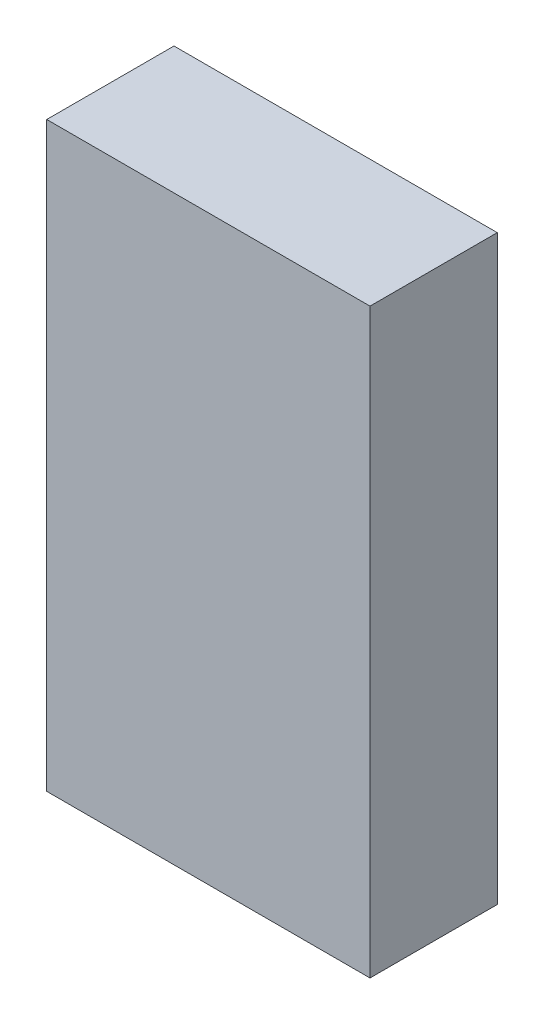
ISO-10303-21;
HEADER;
FILE_DESCRIPTION(('STEP AP214'),'2;1');
FILE_NAME('part.step','',(''),(''),'','','');
FILE_SCHEMA(('AUTOMOTIVE_DESIGN { 1 0 10303 214 1 1 1 1 }'));
ENDSEC;
DATA;
#1=APPLICATION_CONTEXT('core data for automotive mechanical design processes');
#2=APPLICATION_PROTOCOL_DEFINITION('international standard','automotive_design',2000,#1);
#3=PRODUCT_CONTEXT('',#1,'mechanical');
#4=PRODUCT('Part','Part','',(#3));
#5=PRODUCT_RELATED_PRODUCT_CATEGORY('part','',(#4));
#6=PRODUCT_DEFINITION_FORMATION('','',#4);
#7=PRODUCT_DEFINITION_CONTEXT('part definition',#1,'design');
#8=PRODUCT_DEFINITION('design','',#6,#7);
#9=PRODUCT_DEFINITION_SHAPE('','',#8);
#10=(LENGTH_UNIT() NAMED_UNIT(*) SI_UNIT(.MILLI.,.METRE.));
#11=(NAMED_UNIT(*) PLANE_ANGLE_UNIT() SI_UNIT($,.RADIAN.));
#12=(NAMED_UNIT(*) SI_UNIT($,.STERADIAN.) SOLID_ANGLE_UNIT());
#13=UNCERTAINTY_MEASURE_WITH_UNIT(LENGTH_MEASURE(1.E-05),#10,'distance_accuracy_value','');
#14=(GEOMETRIC_REPRESENTATION_CONTEXT(3) GLOBAL_UNCERTAINTY_ASSIGNED_CONTEXT((#13)) GLOBAL_UNIT_ASSIGNED_CONTEXT((#10,
#11,#12)) REPRESENTATION_CONTEXT('',''));
#15=CARTESIAN_POINT('',(0.,0.,0.));
#16=DIRECTION('',(0.,0.,1.));
#17=DIRECTION('',(1.,0.,0.));
#18=AXIS2_PLACEMENT_3D('',#15,#16,#17);
#19=CARTESIAN_POINT('',(-1.27,-2.286,1.));
#20=DIRECTION('',(1.,0.,0.));
#21=DIRECTION('',(0.,0.,-1.));
#22=AXIS2_PLACEMENT_3D('',#19,#20,#21);
#23=PLANE('',#22);
#24=DIRECTION('',(0.,-1.,0.));
#25=VECTOR('',#24,1.);
#26=CARTESIAN_POINT('',(-1.27,-2.286,0.));
#27=LINE('',#26,#25);
#28=CARTESIAN_POINT('',(-1.27,2.286,0.));
#29=VERTEX_POINT('',#28);
#30=CARTESIAN_POINT('',(-1.27,-2.286,0.));
#31=VERTEX_POINT('',#30);
#32=EDGE_CURVE('E95',#29,#31,#27,.T.);
#33=ORIENTED_EDGE('',*,*,#32,.T.);
#34=DIRECTION('',(0.,0.,-1.));
#35=VECTOR('',#34,1.);
#36=CARTESIAN_POINT('',(-1.27,-2.286,1.));
#37=LINE('',#36,#35);
#38=CARTESIAN_POINT('',(-1.27,-2.286,1.));
#39=VERTEX_POINT('',#38);
#40=EDGE_CURVE('E11',#39,#31,#37,.T.);
#41=ORIENTED_EDGE('',*,*,#40,.F.);
#42=DIRECTION('',(0.,-1.,0.));
#43=VECTOR('',#42,1.);
#44=CARTESIAN_POINT('',(-1.27,-2.286,1.));
#45=LINE('',#44,#43);
#46=CARTESIAN_POINT('',(-1.27,2.286,1.));
#47=VERTEX_POINT('',#46);
#48=EDGE_CURVE('E83',#47,#39,#45,.T.);
#49=ORIENTED_EDGE('',*,*,#48,.F.);
#50=DIRECTION('',(0.,0.,-1.));
#51=VECTOR('',#50,1.);
#52=CARTESIAN_POINT('',(-1.27,2.286,1.));
#53=LINE('',#52,#51);
#54=EDGE_CURVE('E91',#47,#29,#53,.T.);
#55=ORIENTED_EDGE('',*,*,#54,.T.);
#56=EDGE_LOOP('',(#33,#41,#49,#55));
#57=FACE_BOUND('',#56,.T.);
#58=ADVANCED_FACE('F32',(#57),#23,.F.);
#59=CARTESIAN_POINT('',(1.27,-2.286,1.));
#60=DIRECTION('',(0.,1.,0.));
#61=DIRECTION('',(0.,0.,1.));
#62=AXIS2_PLACEMENT_3D('',#59,#60,#61);
#63=PLANE('',#62);
#64=DIRECTION('',(1.,0.,0.));
#65=VECTOR('',#64,1.);
#66=CARTESIAN_POINT('',(1.27,-2.286,0.));
#67=LINE('',#66,#65);
#68=CARTESIAN_POINT('',(1.27,-2.286,0.));
#69=VERTEX_POINT('',#68);
#70=EDGE_CURVE('E87',#31,#69,#67,.T.);
#71=ORIENTED_EDGE('',*,*,#70,.T.);
#72=DIRECTION('',(0.,0.,-1.));
#73=VECTOR('',#72,1.);
#74=CARTESIAN_POINT('',(1.27,-2.286,1.));
#75=LINE('',#74,#73);
#76=CARTESIAN_POINT('',(1.27,-2.286,1.));
#77=VERTEX_POINT('',#76);
#78=EDGE_CURVE('E40',#77,#69,#75,.T.);
#79=ORIENTED_EDGE('',*,*,#78,.F.);
#80=DIRECTION('',(1.,0.,0.));
#81=VECTOR('',#80,1.);
#82=CARTESIAN_POINT('',(1.27,-2.286,1.));
#83=LINE('',#82,#81);
#84=EDGE_CURVE('E78',#39,#77,#83,.T.);
#85=ORIENTED_EDGE('',*,*,#84,.F.);
#86=ORIENTED_EDGE('',*,*,#40,.T.);
#87=EDGE_LOOP('',(#71,#79,#85,#86));
#88=FACE_BOUND('',#87,.T.);
#89=ADVANCED_FACE('F86',(#88),#63,.F.);
#90=CARTESIAN_POINT('',(1.27,2.286,1.));
#91=DIRECTION('',(-1.,0.,0.));
#92=DIRECTION('',(0.,0.,1.));
#93=AXIS2_PLACEMENT_3D('',#90,#91,#92);
#94=PLANE('',#93);
#95=DIRECTION('',(0.,1.,0.));
#96=VECTOR('',#95,1.);
#97=CARTESIAN_POINT('',(1.27,2.286,0.));
#98=LINE('',#97,#96);
#99=CARTESIAN_POINT('',(1.27,2.286,0.));
#100=VERTEX_POINT('',#99);
#101=EDGE_CURVE('E65',#69,#100,#98,.T.);
#102=ORIENTED_EDGE('',*,*,#101,.T.);
#103=DIRECTION('',(0.,0.,-1.));
#104=VECTOR('',#103,1.);
#105=CARTESIAN_POINT('',(1.27,2.286,1.));
#106=LINE('',#105,#104);
#107=CARTESIAN_POINT('',(1.27,2.286,1.));
#108=VERTEX_POINT('',#107);
#109=EDGE_CURVE('E88',#108,#100,#106,.T.);
#110=ORIENTED_EDGE('',*,*,#109,.F.);
#111=DIRECTION('',(0.,1.,0.));
#112=VECTOR('',#111,1.);
#113=CARTESIAN_POINT('',(1.27,2.286,1.));
#114=LINE('',#113,#112);
#115=EDGE_CURVE('E81',#77,#108,#114,.T.);
#116=ORIENTED_EDGE('',*,*,#115,.F.);
#117=ORIENTED_EDGE('',*,*,#78,.T.);
#118=EDGE_LOOP('',(#102,#110,#116,#117));
#119=FACE_BOUND('',#118,.T.);
#120=ADVANCED_FACE('F89',(#119),#94,.F.);
#121=CARTESIAN_POINT('',(-1.27,2.286,1.));
#122=DIRECTION('',(0.,-1.,0.));
#123=DIRECTION('',(0.,0.,-1.));
#124=AXIS2_PLACEMENT_3D('',#121,#122,#123);
#125=PLANE('',#124);
#126=DIRECTION('',(-1.,0.,0.));
#127=VECTOR('',#126,1.);
#128=CARTESIAN_POINT('',(-1.27,2.286,0.));
#129=LINE('',#128,#127);
#130=EDGE_CURVE('E71',#100,#29,#129,.T.);
#131=ORIENTED_EDGE('',*,*,#130,.T.);
#132=ORIENTED_EDGE('',*,*,#54,.F.);
#133=DIRECTION('',(-1.,0.,0.));
#134=VECTOR('',#133,1.);
#135=CARTESIAN_POINT('',(-1.27,2.286,1.));
#136=LINE('',#135,#134);
#137=EDGE_CURVE('E48',#108,#47,#136,.T.);
#138=ORIENTED_EDGE('',*,*,#137,.F.);
#139=ORIENTED_EDGE('',*,*,#109,.T.);
#140=EDGE_LOOP('',(#131,#132,#138,#139));
#141=FACE_BOUND('',#140,.T.);
#142=ADVANCED_FACE('F102',(#141),#125,.F.);
#143=CARTESIAN_POINT('',(0.,0.,1.));
#144=DIRECTION('',(0.,0.,-1.));
#145=DIRECTION('',(-1.,0.,0.));
#146=AXIS2_PLACEMENT_3D('',#143,#144,#145);
#147=PLANE('',#146);
#148=ORIENTED_EDGE('',*,*,#48,.T.);
#149=ORIENTED_EDGE('',*,*,#84,.T.);
#150=ORIENTED_EDGE('',*,*,#115,.T.);
#151=ORIENTED_EDGE('',*,*,#137,.T.);
#152=EDGE_LOOP('',(#148,#149,#150,#151));
#153=FACE_BOUND('',#152,.T.);
#154=ADVANCED_FACE('F79',(#153),#147,.F.);
#155=CARTESIAN_POINT('',(0.,0.,0.));
#156=DIRECTION('',(0.,0.,-1.));
#157=DIRECTION('',(-1.,0.,0.));
#158=AXIS2_PLACEMENT_3D('',#155,#156,#157);
#159=PLANE('',#158);
#160=ORIENTED_EDGE('',*,*,#32,.F.);
#161=ORIENTED_EDGE('',*,*,#130,.F.);
#162=ORIENTED_EDGE('',*,*,#101,.F.);
#163=ORIENTED_EDGE('',*,*,#70,.F.);
#164=EDGE_LOOP('',(#160,#161,#162,#163));
#165=FACE_BOUND('',#164,.T.);
#166=ADVANCED_FACE('F105',(#165),#159,.T.);
#167=CLOSED_SHELL('',(#58,#89,#120,#142,#154,#166));
#168=MANIFOLD_SOLID_BREP('B2',#167);
#169=ADVANCED_BREP_SHAPE_REPRESENTATION('',(#18,#168),#14);
#170=SHAPE_DEFINITION_REPRESENTATION(#9,#169);
ENDSEC;
END-ISO-10303-21;
